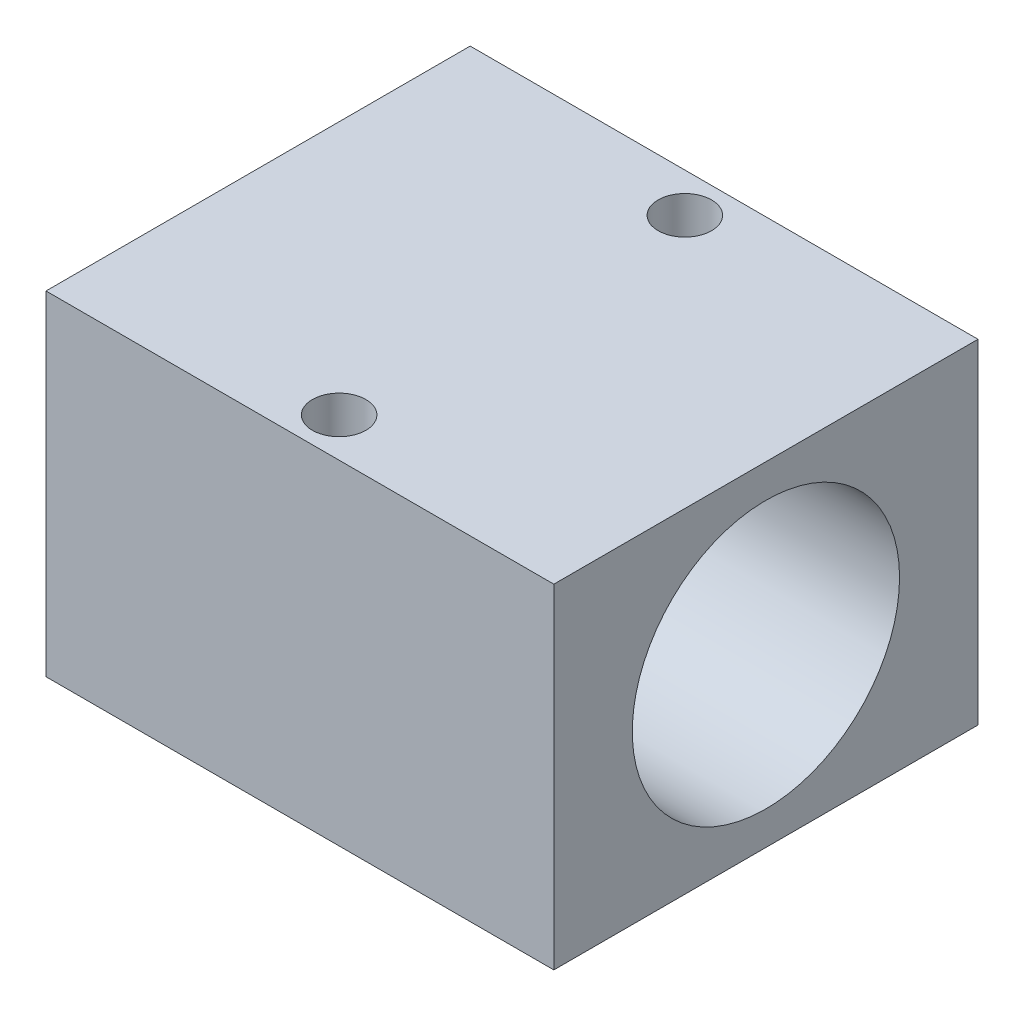
ISO-10303-21;
HEADER;
FILE_DESCRIPTION(('STEP AP214'),'2;1');
FILE_NAME('part.step','',(''),(''),'','','');
FILE_SCHEMA(('AUTOMOTIVE_DESIGN { 1 0 10303 214 1 1 1 1 }'));
ENDSEC;
DATA;
#1=APPLICATION_CONTEXT('core data for automotive mechanical design processes');
#2=APPLICATION_PROTOCOL_DEFINITION('international standard','automotive_design',2000,#1);
#3=PRODUCT_CONTEXT('',#1,'mechanical');
#4=PRODUCT('Part','Part','',(#3));
#5=PRODUCT_RELATED_PRODUCT_CATEGORY('part','',(#4));
#6=PRODUCT_DEFINITION_FORMATION('','',#4);
#7=PRODUCT_DEFINITION_CONTEXT('part definition',#1,'design');
#8=PRODUCT_DEFINITION('design','',#6,#7);
#9=PRODUCT_DEFINITION_SHAPE('','',#8);
#10=(LENGTH_UNIT() NAMED_UNIT(*) SI_UNIT(.MILLI.,.METRE.));
#11=(NAMED_UNIT(*) PLANE_ANGLE_UNIT() SI_UNIT($,.RADIAN.));
#12=(NAMED_UNIT(*) SI_UNIT($,.STERADIAN.) SOLID_ANGLE_UNIT());
#13=UNCERTAINTY_MEASURE_WITH_UNIT(LENGTH_MEASURE(1.E-05),#10,'distance_accuracy_value','');
#14=(GEOMETRIC_REPRESENTATION_CONTEXT(3) GLOBAL_UNCERTAINTY_ASSIGNED_CONTEXT((#13)) GLOBAL_UNIT_ASSIGNED_CONTEXT((#10,
#11,#12)) REPRESENTATION_CONTEXT('',''));
#15=CARTESIAN_POINT('',(0.,0.,0.));
#16=DIRECTION('',(0.,0.,1.));
#17=DIRECTION('',(1.,0.,0.));
#18=AXIS2_PLACEMENT_3D('',#15,#16,#17);
#19=CARTESIAN_POINT('',(-9.5,12.5,7.935));
#20=DIRECTION('',(1.,0.,0.));
#21=DIRECTION('',(0.,0.,-1.));
#22=AXIS2_PLACEMENT_3D('',#19,#20,#21);
#23=PLANE('',#22);
#24=CARTESIAN_POINT('',(-9.5,6.25,0.));
#25=DIRECTION('',(1.,0.,0.));
#26=DIRECTION('',(0.,0.,-1.));
#27=AXIS2_PLACEMENT_3D('',#24,#25,#26);
#28=CIRCLE('',#27,5.);
#29=CARTESIAN_POINT('',(-9.5,6.25,-5.00000000000001));
#30=VERTEX_POINT('',#29);
#31=EDGE_CURVE('E100',#30,#30,#28,.T.);
#32=ORIENTED_EDGE('',*,*,#31,.T.);
#33=EDGE_LOOP('',(#32));
#34=FACE_BOUND('',#33,.T.);
#35=DIRECTION('',(0.,0.,1.));
#36=VECTOR('',#35,1.);
#37=CARTESIAN_POINT('',(-9.5,0.,7.935));
#38=LINE('',#37,#36);
#39=CARTESIAN_POINT('',(-9.5,0.,-7.935));
#40=VERTEX_POINT('',#39);
#41=CARTESIAN_POINT('',(-9.5,0.,7.935));
#42=VERTEX_POINT('',#41);
#43=EDGE_CURVE('E97',#40,#42,#38,.T.);
#44=ORIENTED_EDGE('',*,*,#43,.T.);
#45=DIRECTION('',(0.,-1.,0.));
#46=VECTOR('',#45,1.);
#47=CARTESIAN_POINT('',(-9.5,12.5,7.935));
#48=LINE('',#47,#46);
#49=CARTESIAN_POINT('',(-9.5,12.5,7.935));
#50=VERTEX_POINT('',#49);
#51=EDGE_CURVE('E11',#50,#42,#48,.T.);
#52=ORIENTED_EDGE('',*,*,#51,.F.);
#53=DIRECTION('',(0.,0.,1.));
#54=VECTOR('',#53,1.);
#55=CARTESIAN_POINT('',(-9.5,12.5,7.935));
#56=LINE('',#55,#54);
#57=CARTESIAN_POINT('',(-9.5,12.5,-7.935));
#58=VERTEX_POINT('',#57);
#59=EDGE_CURVE('E84',#58,#50,#56,.T.);
#60=ORIENTED_EDGE('',*,*,#59,.F.);
#61=DIRECTION('',(0.,-1.,0.));
#62=VECTOR('',#61,1.);
#63=CARTESIAN_POINT('',(-9.5,12.5,-7.935));
#64=LINE('',#63,#62);
#65=EDGE_CURVE('E93',#58,#40,#64,.T.);
#66=ORIENTED_EDGE('',*,*,#65,.T.);
#67=EDGE_LOOP('',(#44,#52,#60,#66));
#68=FACE_BOUND('',#67,.T.);
#69=ADVANCED_FACE('F31',(#34,#68),#23,.F.);
#70=CARTESIAN_POINT('',(-9.5,12.5,7.935));
#71=DIRECTION('',(0.,0.,-1.));
#72=DIRECTION('',(-1.,0.,0.));
#73=AXIS2_PLACEMENT_3D('',#70,#71,#72);
#74=PLANE('',#73);
#75=DIRECTION('',(1.,0.,0.));
#76=VECTOR('',#75,1.);
#77=CARTESIAN_POINT('',(-9.5,0.,7.935));
#78=LINE('',#77,#76);
#79=CARTESIAN_POINT('',(9.5,0.,7.935));
#80=VERTEX_POINT('',#79);
#81=EDGE_CURVE('E88',#42,#80,#78,.T.);
#82=ORIENTED_EDGE('',*,*,#81,.T.);
#83=DIRECTION('',(0.,-1.,0.));
#84=VECTOR('',#83,1.);
#85=CARTESIAN_POINT('',(9.5,12.5,7.935));
#86=LINE('',#85,#84);
#87=CARTESIAN_POINT('',(9.5,12.5,7.935));
#88=VERTEX_POINT('',#87);
#89=EDGE_CURVE('E40',#88,#80,#86,.T.);
#90=ORIENTED_EDGE('',*,*,#89,.F.);
#91=DIRECTION('',(1.,0.,0.));
#92=VECTOR('',#91,1.);
#93=CARTESIAN_POINT('',(-9.5,12.5,7.935));
#94=LINE('',#93,#92);
#95=EDGE_CURVE('E79',#50,#88,#94,.T.);
#96=ORIENTED_EDGE('',*,*,#95,.F.);
#97=ORIENTED_EDGE('',*,*,#51,.T.);
#98=EDGE_LOOP('',(#82,#90,#96,#97));
#99=FACE_BOUND('',#98,.T.);
#100=ADVANCED_FACE('F87',(#99),#74,.F.);
#101=CARTESIAN_POINT('',(9.5,12.5,7.935));
#102=DIRECTION('',(-1.,0.,0.));
#103=DIRECTION('',(0.,0.,1.));
#104=AXIS2_PLACEMENT_3D('',#101,#102,#103);
#105=PLANE('',#104);
#106=CARTESIAN_POINT('',(9.5,6.25,0.));
#107=DIRECTION('',(1.,0.,0.));
#108=DIRECTION('',(0.,0.,-1.));
#109=AXIS2_PLACEMENT_3D('',#106,#107,#108);
#110=CIRCLE('',#109,5.);
#111=CARTESIAN_POINT('',(9.5,6.25,-5.00000000000001));
#112=VERTEX_POINT('',#111);
#113=EDGE_CURVE('E107',#112,#112,#110,.T.);
#114=ORIENTED_EDGE('',*,*,#113,.F.);
#115=EDGE_LOOP('',(#114));
#116=FACE_BOUND('',#115,.T.);
#117=DIRECTION('',(0.,0.,-1.));
#118=VECTOR('',#117,1.);
#119=CARTESIAN_POINT('',(9.5,0.,7.935));
#120=LINE('',#119,#118);
#121=CARTESIAN_POINT('',(9.5,0.,-7.935));
#122=VERTEX_POINT('',#121);
#123=EDGE_CURVE('E66',#80,#122,#120,.T.);
#124=ORIENTED_EDGE('',*,*,#123,.T.);
#125=DIRECTION('',(0.,-1.,0.));
#126=VECTOR('',#125,1.);
#127=CARTESIAN_POINT('',(9.5,12.5,-7.935));
#128=LINE('',#127,#126);
#129=CARTESIAN_POINT('',(9.5,12.5,-7.935));
#130=VERTEX_POINT('',#129);
#131=EDGE_CURVE('E89',#130,#122,#128,.T.);
#132=ORIENTED_EDGE('',*,*,#131,.F.);
#133=DIRECTION('',(0.,0.,-1.));
#134=VECTOR('',#133,1.);
#135=CARTESIAN_POINT('',(9.5,12.5,7.935));
#136=LINE('',#135,#134);
#137=EDGE_CURVE('E82',#88,#130,#136,.T.);
#138=ORIENTED_EDGE('',*,*,#137,.F.);
#139=ORIENTED_EDGE('',*,*,#89,.T.);
#140=EDGE_LOOP('',(#124,#132,#138,#139));
#141=FACE_BOUND('',#140,.T.);
#142=ADVANCED_FACE('F91',(#116,#141),#105,.F.);
#143=CARTESIAN_POINT('',(-9.5,12.5,-7.935));
#144=DIRECTION('',(0.,0.,1.));
#145=DIRECTION('',(1.,0.,0.));
#146=AXIS2_PLACEMENT_3D('',#143,#144,#145);
#147=PLANE('',#146);
#148=DIRECTION('',(-1.,0.,0.));
#149=VECTOR('',#148,1.);
#150=CARTESIAN_POINT('',(-9.5,0.,-7.935));
#151=LINE('',#150,#149);
#152=EDGE_CURVE('E72',#122,#40,#151,.T.);
#153=ORIENTED_EDGE('',*,*,#152,.T.);
#154=ORIENTED_EDGE('',*,*,#65,.F.);
#155=DIRECTION('',(-1.,0.,0.));
#156=VECTOR('',#155,1.);
#157=CARTESIAN_POINT('',(-9.5,12.5,-7.935));
#158=LINE('',#157,#156);
#159=EDGE_CURVE('E49',#130,#58,#158,.T.);
#160=ORIENTED_EDGE('',*,*,#159,.F.);
#161=ORIENTED_EDGE('',*,*,#131,.T.);
#162=EDGE_LOOP('',(#153,#154,#160,#161));
#163=FACE_BOUND('',#162,.T.);
#164=ADVANCED_FACE('F148',(#163),#147,.F.);
#165=CARTESIAN_POINT('',(-9.5,12.5,-7.935));
#166=DIRECTION('',(0.,-1.,0.));
#167=DIRECTION('',(0.,0.,-1.));
#168=AXIS2_PLACEMENT_3D('',#165,#166,#167);
#169=PLANE('',#168);
#170=CARTESIAN_POINT('',(0.,12.5,-6.4675));
#171=DIRECTION('',(0.,1.,0.));
#172=DIRECTION('',(0.,0.,-1.));
#173=AXIS2_PLACEMENT_3D('',#170,#171,#172);
#174=CIRCLE('',#173,1.);
#175=CARTESIAN_POINT('',(0.,12.5,-7.4675));
#176=VERTEX_POINT('',#175);
#177=EDGE_CURVE('E118',#176,#176,#174,.T.);
#178=ORIENTED_EDGE('',*,*,#177,.F.);
#179=EDGE_LOOP('',(#178));
#180=FACE_BOUND('',#179,.T.);
#181=CARTESIAN_POINT('',(0.,12.5,6.4675));
#182=DIRECTION('',(0.,1.,0.));
#183=DIRECTION('',(0.,0.,1.));
#184=AXIS2_PLACEMENT_3D('',#181,#182,#183);
#185=CIRCLE('',#184,1.);
#186=CARTESIAN_POINT('',(0.,12.5,7.4675));
#187=VERTEX_POINT('',#186);
#188=EDGE_CURVE('E108',#187,#187,#185,.T.);
#189=ORIENTED_EDGE('',*,*,#188,.F.);
#190=EDGE_LOOP('',(#189));
#191=FACE_BOUND('',#190,.T.);
#192=ORIENTED_EDGE('',*,*,#59,.T.);
#193=ORIENTED_EDGE('',*,*,#95,.T.);
#194=ORIENTED_EDGE('',*,*,#137,.T.);
#195=ORIENTED_EDGE('',*,*,#159,.T.);
#196=EDGE_LOOP('',(#192,#193,#194,#195));
#197=FACE_BOUND('',#196,.T.);
#198=ADVANCED_FACE('F80',(#180,#191,#197),#169,.F.);
#199=CARTESIAN_POINT('',(-9.5,0.,-7.935));
#200=DIRECTION('',(0.,-1.,0.));
#201=DIRECTION('',(0.,0.,-1.));
#202=AXIS2_PLACEMENT_3D('',#199,#200,#201);
#203=PLANE('',#202);
#204=CARTESIAN_POINT('',(0.,0.,-6.4675));
#205=DIRECTION('',(0.,-1.,0.));
#206=DIRECTION('',(0.,0.,-1.));
#207=AXIS2_PLACEMENT_3D('',#204,#205,#206);
#208=CIRCLE('',#207,1.);
#209=CARTESIAN_POINT('',(0.,0.,-7.4675));
#210=VERTEX_POINT('',#209);
#211=EDGE_CURVE('E34',#210,#210,#208,.T.);
#212=ORIENTED_EDGE('',*,*,#211,.F.);
#213=EDGE_LOOP('',(#212));
#214=FACE_BOUND('',#213,.T.);
#215=CARTESIAN_POINT('',(0.,0.,6.4675));
#216=DIRECTION('',(0.,-1.,0.));
#217=DIRECTION('',(0.,0.,-1.));
#218=AXIS2_PLACEMENT_3D('',#215,#216,#217);
#219=CIRCLE('',#218,1.);
#220=CARTESIAN_POINT('',(0.,0.,5.4675));
#221=VERTEX_POINT('',#220);
#222=EDGE_CURVE('E105',#221,#221,#219,.T.);
#223=ORIENTED_EDGE('',*,*,#222,.F.);
#224=EDGE_LOOP('',(#223));
#225=FACE_BOUND('',#224,.T.);
#226=ORIENTED_EDGE('',*,*,#43,.F.);
#227=ORIENTED_EDGE('',*,*,#152,.F.);
#228=ORIENTED_EDGE('',*,*,#123,.F.);
#229=ORIENTED_EDGE('',*,*,#81,.F.);
#230=EDGE_LOOP('',(#226,#227,#228,#229));
#231=FACE_BOUND('',#230,.T.);
#232=ADVANCED_FACE('F129',(#214,#225,#231),#203,.T.);
#233=CARTESIAN_POINT('',(-13.,6.25,0.));
#234=DIRECTION('',(1.,0.,0.));
#235=DIRECTION('',(0.,0.,-1.));
#236=AXIS2_PLACEMENT_3D('',#233,#234,#235);
#237=CYLINDRICAL_SURFACE('',#236,5.);
#238=ORIENTED_EDGE('',*,*,#113,.T.);
#239=EDGE_LOOP('',(#238));
#240=FACE_BOUND('',#239,.T.);
#241=ORIENTED_EDGE('',*,*,#31,.F.);
#242=EDGE_LOOP('',(#241));
#243=FACE_BOUND('',#242,.T.);
#244=ADVANCED_FACE('F126',(#240,#243),#237,.F.);
#245=CARTESIAN_POINT('',(0.,-10.,6.4675));
#246=DIRECTION('',(0.,1.,0.));
#247=DIRECTION('',(0.,0.,1.));
#248=AXIS2_PLACEMENT_3D('',#245,#246,#247);
#249=CYLINDRICAL_SURFACE('',#248,1.);
#250=ORIENTED_EDGE('',*,*,#222,.T.);
#251=EDGE_LOOP('',(#250));
#252=FACE_BOUND('',#251,.T.);
#253=ORIENTED_EDGE('',*,*,#188,.T.);
#254=EDGE_LOOP('',(#253));
#255=FACE_BOUND('',#254,.T.);
#256=ADVANCED_FACE('F128',(#252,#255),#249,.F.);
#257=CARTESIAN_POINT('',(0.,-10.,-6.4675));
#258=DIRECTION('',(0.,1.,0.));
#259=DIRECTION('',(0.,0.,1.));
#260=AXIS2_PLACEMENT_3D('',#257,#258,#259);
#261=CYLINDRICAL_SURFACE('',#260,1.);
#262=ORIENTED_EDGE('',*,*,#211,.T.);
#263=EDGE_LOOP('',(#262));
#264=FACE_BOUND('',#263,.T.);
#265=ORIENTED_EDGE('',*,*,#177,.T.);
#266=EDGE_LOOP('',(#265));
#267=FACE_BOUND('',#266,.T.);
#268=ADVANCED_FACE('F136',(#264,#267),#261,.F.);
#269=CLOSED_SHELL('',(#69,#100,#142,#164,#198,#232,#244,#256,#268));
#270=MANIFOLD_SOLID_BREP('B2',#269);
#271=ADVANCED_BREP_SHAPE_REPRESENTATION('',(#18,#270),#14);
#272=SHAPE_DEFINITION_REPRESENTATION(#9,#271);
ENDSEC;
END-ISO-10303-21;
